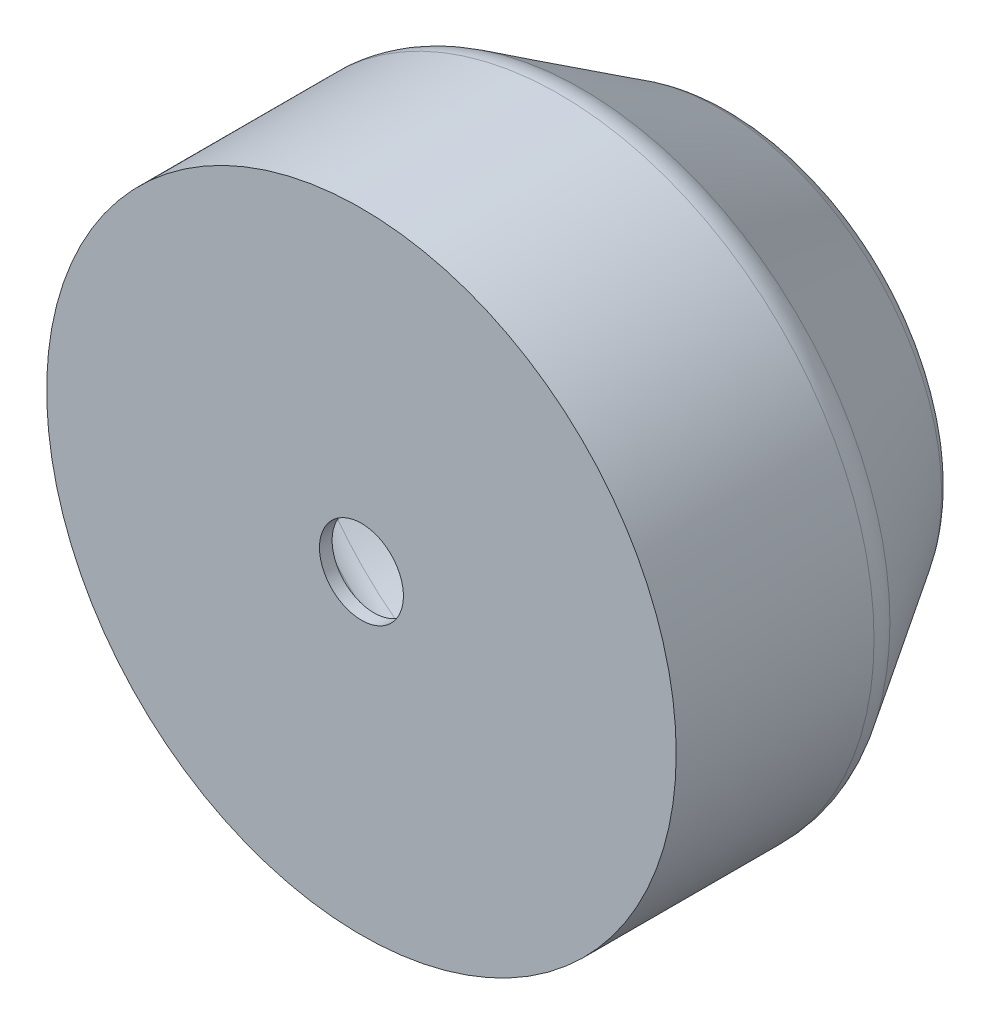
ISO-10303-21;
HEADER;
FILE_DESCRIPTION(('STEP AP214'),'2;1');
FILE_NAME('part.step','',(''),(''),'','','');
FILE_SCHEMA(('AUTOMOTIVE_DESIGN { 1 0 10303 214 1 1 1 1 }'));
ENDSEC;
DATA;
#1=APPLICATION_CONTEXT('core data for automotive mechanical design processes');
#2=APPLICATION_PROTOCOL_DEFINITION('international standard','automotive_design',2000,#1);
#3=PRODUCT_CONTEXT('',#1,'mechanical');
#4=PRODUCT('Part','Part','',(#3));
#5=PRODUCT_RELATED_PRODUCT_CATEGORY('part','',(#4));
#6=PRODUCT_DEFINITION_FORMATION('','',#4);
#7=PRODUCT_DEFINITION_CONTEXT('part definition',#1,'design');
#8=PRODUCT_DEFINITION('design','',#6,#7);
#9=PRODUCT_DEFINITION_SHAPE('','',#8);
#10=(LENGTH_UNIT() NAMED_UNIT(*) SI_UNIT(.MILLI.,.METRE.));
#11=(NAMED_UNIT(*) PLANE_ANGLE_UNIT() SI_UNIT($,.RADIAN.));
#12=(NAMED_UNIT(*) SI_UNIT($,.STERADIAN.) SOLID_ANGLE_UNIT());
#13=UNCERTAINTY_MEASURE_WITH_UNIT(LENGTH_MEASURE(1.E-05),#10,'distance_accuracy_value','');
#14=(GEOMETRIC_REPRESENTATION_CONTEXT(3) GLOBAL_UNCERTAINTY_ASSIGNED_CONTEXT((#13)) GLOBAL_UNIT_ASSIGNED_CONTEXT((#10,
#11,#12)) REPRESENTATION_CONTEXT('',''));
#15=CARTESIAN_POINT('',(0.,0.,0.));
#16=DIRECTION('',(0.,0.,1.));
#17=DIRECTION('',(1.,0.,0.));
#18=AXIS2_PLACEMENT_3D('',#15,#16,#17);
#19=CARTESIAN_POINT('',(0.,0.,50.));
#20=DIRECTION('',(0.,0.,-1.));
#21=DIRECTION('',(-1.,0.,0.));
#22=AXIS2_PLACEMENT_3D('',#19,#20,#21);
#23=CYLINDRICAL_SURFACE('',#22,10.);
#24=CARTESIAN_POINT('',(0.,0.,-40.));
#25=DIRECTION('',(0.,0.,-1.));
#26=DIRECTION('',(-1.,0.,0.));
#27=AXIS2_PLACEMENT_3D('',#24,#25,#26);
#28=CIRCLE('',#27,10.);
#29=CARTESIAN_POINT('',(-10.,0.,-40.));
#30=VERTEX_POINT('',#29);
#31=EDGE_CURVE('E57',#30,#30,#28,.T.);
#32=CARTESIAN_POINT('',(0.,0.,-37.));
#33=DIRECTION('',(0.,0.,-1.));
#34=DIRECTION('',(-1.,0.,0.));
#35=AXIS2_PLACEMENT_3D('',#32,#33,#34);
#36=CIRCLE('',#35,10.);
#37=CARTESIAN_POINT('',(-10.,0.,-37.));
#38=VERTEX_POINT('',#37);
#39=EDGE_CURVE('E63',#38,#38,#36,.T.);
#40=CARTESIAN_POINT('',(-10.,0.,-40.));
#41=CARTESIAN_POINT('',(-10.,0.,-39.96875));
#42=CARTESIAN_POINT('',(-10.,0.,-39.9375));
#43=CARTESIAN_POINT('',(-10.,0.,-39.875));
#44=CARTESIAN_POINT('',(-10.,0.,-39.84375));
#45=CARTESIAN_POINT('',(-10.,0.,-39.78125));
#46=CARTESIAN_POINT('',(-10.,0.,-39.75));
#47=CARTESIAN_POINT('',(-10.,0.,-39.6875));
#48=CARTESIAN_POINT('',(-10.,0.,-39.65625));
#49=CARTESIAN_POINT('',(-10.,0.,-39.59375));
#50=CARTESIAN_POINT('',(-10.,0.,-39.5625));
#51=CARTESIAN_POINT('',(-10.,0.,-39.5));
#52=CARTESIAN_POINT('',(-10.,0.,-39.46875));
#53=CARTESIAN_POINT('',(-10.,0.,-39.40625));
#54=CARTESIAN_POINT('',(-10.,0.,-39.375));
#55=CARTESIAN_POINT('',(-10.,0.,-39.3125));
#56=CARTESIAN_POINT('',(-10.,0.,-39.28125));
#57=CARTESIAN_POINT('',(-10.,0.,-39.21875));
#58=CARTESIAN_POINT('',(-10.,0.,-39.1875));
#59=CARTESIAN_POINT('',(-10.,0.,-39.125));
#60=CARTESIAN_POINT('',(-10.,0.,-39.09375));
#61=CARTESIAN_POINT('',(-10.,0.,-39.03125));
#62=CARTESIAN_POINT('',(-10.,0.,-39.));
#63=CARTESIAN_POINT('',(-10.,0.,-38.9375));
#64=CARTESIAN_POINT('',(-10.,0.,-38.90625));
#65=CARTESIAN_POINT('',(-10.,0.,-38.84375));
#66=CARTESIAN_POINT('',(-10.,0.,-38.8125));
#67=CARTESIAN_POINT('',(-10.,0.,-38.75));
#68=CARTESIAN_POINT('',(-10.,0.,-38.71875));
#69=CARTESIAN_POINT('',(-10.,0.,-38.65625));
#70=CARTESIAN_POINT('',(-10.,0.,-38.625));
#71=CARTESIAN_POINT('',(-10.,0.,-38.5625));
#72=CARTESIAN_POINT('',(-10.,0.,-38.53125));
#73=CARTESIAN_POINT('',(-10.,0.,-38.46875));
#74=CARTESIAN_POINT('',(-10.,0.,-38.4375));
#75=CARTESIAN_POINT('',(-10.,0.,-38.375));
#76=CARTESIAN_POINT('',(-10.,0.,-38.34375));
#77=CARTESIAN_POINT('',(-10.,0.,-38.28125));
#78=CARTESIAN_POINT('',(-10.,0.,-38.25));
#79=CARTESIAN_POINT('',(-10.,0.,-38.1875));
#80=CARTESIAN_POINT('',(-10.,0.,-38.15625));
#81=CARTESIAN_POINT('',(-10.,0.,-38.09375));
#82=CARTESIAN_POINT('',(-10.,0.,-38.0625));
#83=CARTESIAN_POINT('',(-10.,0.,-38.));
#84=CARTESIAN_POINT('',(-10.,0.,-37.96875));
#85=CARTESIAN_POINT('',(-10.,0.,-37.90625));
#86=CARTESIAN_POINT('',(-10.,0.,-37.875));
#87=CARTESIAN_POINT('',(-10.,0.,-37.8125));
#88=CARTESIAN_POINT('',(-10.,0.,-37.78125));
#89=CARTESIAN_POINT('',(-10.,0.,-37.71875));
#90=CARTESIAN_POINT('',(-10.,0.,-37.6875));
#91=CARTESIAN_POINT('',(-10.,0.,-37.625));
#92=CARTESIAN_POINT('',(-10.,0.,-37.59375));
#93=CARTESIAN_POINT('',(-10.,0.,-37.53125));
#94=CARTESIAN_POINT('',(-10.,0.,-37.5));
#95=CARTESIAN_POINT('',(-10.,0.,-37.4375));
#96=CARTESIAN_POINT('',(-10.,0.,-37.40625));
#97=CARTESIAN_POINT('',(-10.,0.,-37.34375));
#98=CARTESIAN_POINT('',(-10.,0.,-37.3125));
#99=CARTESIAN_POINT('',(-10.,0.,-37.25));
#100=CARTESIAN_POINT('',(-10.,0.,-37.21875));
#101=CARTESIAN_POINT('',(-10.,0.,-37.15625));
#102=CARTESIAN_POINT('',(-10.,0.,-37.125));
#103=CARTESIAN_POINT('',(-10.,0.,-37.0625));
#104=CARTESIAN_POINT('',(-10.,0.,-37.03125));
#105=CARTESIAN_POINT('',(-10.,0.,-37.));
#106=B_SPLINE_CURVE_WITH_KNOTS('',3,(#40,#41,#42,#43,#44,#45,#46,#47,#48,#49,#50,#51,#52,#53,
#54,#55,#56,#57,#58,#59,#60,#61,#62,#63,#64,#65,#66,#67,#68,#69,#70,#71,#72,#73,#74,#75,#76,#77,
#78,#79,#80,#81,#82,#83,#84,#85,#86,#87,#88,#89,#90,#91,#92,#93,#94,#95,#96,#97,#98,#99,#100,
#101,#102,#103,#104,#105),.UNSPECIFIED.,.F.,.F.,(4,2,2,2,2,2,2,2,2,2,2,2,2,2,2,2,2,2,2,2,2,2,2,
2,2,2,2,2,2,2,2,2,4),(0.,0.0937500000000036,0.187500000000007,0.281249999999997,0.375,
0.468750000000004,0.562499999999994,0.656249999999997,0.750000000000001,0.843750000000004,
0.937500000000008,1.03125,1.125,1.21875,1.31249999999999,1.40625,1.5,1.59375,1.68750000000001,
1.78125,1.875,1.96875000000001,2.06249999999999,2.15625,2.25,2.34375000000001,2.43750000000001,
2.53125,2.625,2.71875000000001,2.8125,2.90625,3.),.UNSPECIFIED.);
#107=EDGE_CURVE('BSEAM33',#30,#38,#106,.T.);
#108=ORIENTED_EDGE('',*,*,#31,.T.);
#109=ORIENTED_EDGE('',*,*,#39,.F.);
#110=ORIENTED_EDGE('',*,*,#107,.T.);
#111=ORIENTED_EDGE('',*,*,#107,.F.);
#112=EDGE_LOOP('',(#108,#110,#109,#111));
#113=FACE_BOUND('',#112,.T.);
#114=ADVANCED_FACE('F33',(#113),#23,.F.);
#115=CARTESIAN_POINT('',(0.,0.,50.));
#116=DIRECTION('',(0.,0.,-1.));
#117=DIRECTION('',(-1.,0.,0.));
#118=AXIS2_PLACEMENT_3D('',#115,#116,#117);
#119=CYLINDRICAL_SURFACE('',#118,75.);
#120=CARTESIAN_POINT('',(0.,0.,2.86796226411316));
#121=DIRECTION('',(0.,0.,1.));
#122=DIRECTION('',(1.,0.,0.));
#123=AXIS2_PLACEMENT_3D('',#120,#121,#122);
#124=CIRCLE('',#123,75.);
#125=CARTESIAN_POINT('',(75.,0.,2.86796226411316));
#126=VERTEX_POINT('',#125);
#127=EDGE_CURVE('E11',#126,#126,#124,.T.);
#128=ORIENTED_EDGE('',*,*,#127,.T.);
#129=EDGE_LOOP('',(#128));
#130=FACE_BOUND('',#129,.T.);
#131=CARTESIAN_POINT('',(0.,0.,50.));
#132=DIRECTION('',(0.,0.,1.));
#133=DIRECTION('',(1.,0.,0.));
#134=AXIS2_PLACEMENT_3D('',#131,#132,#133);
#135=CIRCLE('',#134,75.);
#136=CARTESIAN_POINT('',(75.,0.,50.));
#137=VERTEX_POINT('',#136);
#138=EDGE_CURVE('E53',#137,#137,#135,.T.);
#139=ORIENTED_EDGE('',*,*,#138,.F.);
#140=EDGE_LOOP('',(#139));
#141=FACE_BOUND('',#140,.T.);
#142=ADVANCED_FACE('F107',(#130,#141),#119,.T.);
#143=CARTESIAN_POINT('',(0.,0.,50.));
#144=DIRECTION('',(0.,0.,1.));
#145=DIRECTION('',(1.,0.,0.));
#146=AXIS2_PLACEMENT_3D('',#143,#144,#145);
#147=PLANE('',#146);
#148=CARTESIAN_POINT('',(0.,0.,50.));
#149=DIRECTION('',(0.,0.,-1.));
#150=DIRECTION('',(-1.,0.,0.));
#151=AXIS2_PLACEMENT_3D('',#148,#149,#150);
#152=CIRCLE('',#151,10.);
#153=CARTESIAN_POINT('',(-10.,0.,50.));
#154=VERTEX_POINT('',#153);
#155=EDGE_CURVE('E56',#154,#154,#152,.T.);
#156=ORIENTED_EDGE('',*,*,#155,.T.);
#157=EDGE_LOOP('',(#156));
#158=FACE_BOUND('',#157,.T.);
#159=ORIENTED_EDGE('',*,*,#138,.T.);
#160=EDGE_LOOP('',(#159));
#161=FACE_BOUND('',#160,.T.);
#162=ADVANCED_FACE('F113',(#158,#161),#147,.T.);
#163=CARTESIAN_POINT('',(0.,0.,-40.));
#164=DIRECTION('',(0.,0.,-1.));
#165=DIRECTION('',(-1.,0.,0.));
#166=AXIS2_PLACEMENT_3D('',#163,#164,#165);
#167=PLANE('',#166);
#168=ORIENTED_EDGE('',*,*,#31,.F.);
#169=EDGE_LOOP('',(#168));
#170=FACE_BOUND('',#169,.T.);
#171=CARTESIAN_POINT('',(0.,0.,-40.));
#172=DIRECTION('',(0.,0.,-1.));
#173=DIRECTION('',(-1.,0.,0.));
#174=AXIS2_PLACEMENT_3D('',#171,#172,#173);
#175=CIRCLE('',#174,44.4575235849292);
#176=CARTESIAN_POINT('',(-44.4575235849292,0.,-40.));
#177=VERTEX_POINT('',#176);
#178=EDGE_CURVE('E48',#177,#177,#175,.T.);
#179=ORIENTED_EDGE('',*,*,#178,.T.);
#180=EDGE_LOOP('',(#179));
#181=FACE_BOUND('',#180,.T.);
#182=ADVANCED_FACE('F130',(#170,#181),#167,.T.);
#183=CARTESIAN_POINT('',(0.,0.,-40.));
#184=DIRECTION('',(0.,0.,1.));
#185=DIRECTION('',(1.,0.,0.));
#186=AXIS2_PLACEMENT_3D('',#183,#184,#185);
#187=CONICAL_SURFACE('',#186,50.,0.558599315343563);
#188=CARTESIAN_POINT('',(0.,0.,-35.2999894000318));
#189=DIRECTION('',(0.,0.,-1.));
#190=DIRECTION('',(-1.,0.,0.));
#191=AXIS2_PLACEMENT_3D('',#188,#189,#190);
#192=CIRCLE('',#191,52.9375066249801);
#193=CARTESIAN_POINT('',(-52.9375066249801,0.,-35.2999894000318));
#194=VERTEX_POINT('',#193);
#195=EDGE_CURVE('E40',#194,#194,#192,.F.);
#196=ORIENTED_EDGE('',*,*,#195,.T.);
#197=EDGE_LOOP('',(#196));
#198=FACE_BOUND('',#197,.T.);
#199=CARTESIAN_POINT('',(0.,0.,-2.43202713591865));
#200=DIRECTION('',(0.,0.,1.));
#201=DIRECTION('',(1.,0.,0.));
#202=AXIS2_PLACEMENT_3D('',#199,#200,#201);
#203=CIRCLE('',#202,73.4799830400509);
#204=CARTESIAN_POINT('',(73.4799830400509,0.,-2.43202713591865));
#205=VERTEX_POINT('',#204);
#206=EDGE_CURVE('E44',#205,#205,#203,.F.);
#207=ORIENTED_EDGE('',*,*,#206,.T.);
#208=EDGE_LOOP('',(#207));
#209=FACE_BOUND('',#208,.T.);
#210=ADVANCED_FACE('F137',(#198,#209),#187,.T.);
#211=CARTESIAN_POINT('',(0.,0.,-30.));
#212=DIRECTION('',(0.,0.,-1.));
#213=DIRECTION('',(-1.,0.,0.));
#214=AXIS2_PLACEMENT_3D('',#211,#212,#213);
#215=TOROIDAL_SURFACE('',#214,44.4575235849292,10.);
#216=ORIENTED_EDGE('',*,*,#195,.F.);
#217=EDGE_LOOP('',(#216));
#218=FACE_BOUND('',#217,.T.);
#219=ORIENTED_EDGE('',*,*,#178,.F.);
#220=EDGE_LOOP('',(#219));
#221=FACE_BOUND('',#220,.T.);
#222=ADVANCED_FACE('F123',(#218,#221),#215,.T.);
#223=CARTESIAN_POINT('',(0.,0.,2.86796226411316));
#224=DIRECTION('',(0.,0.,1.));
#225=DIRECTION('',(1.,0.,0.));
#226=AXIS2_PLACEMENT_3D('',#223,#224,#225);
#227=TOROIDAL_SURFACE('',#226,65.,10.);
#228=ORIENTED_EDGE('',*,*,#127,.F.);
#229=EDGE_LOOP('',(#228));
#230=FACE_BOUND('',#229,.T.);
#231=ORIENTED_EDGE('',*,*,#206,.F.);
#232=EDGE_LOOP('',(#231));
#233=FACE_BOUND('',#232,.T.);
#234=ADVANCED_FACE('F35',(#230,#233),#227,.T.);
#235=CARTESIAN_POINT('',(0.,0.,47.));
#236=DIRECTION('',(0.,0.,1.));
#237=DIRECTION('',(1.,0.,0.));
#238=AXIS2_PLACEMENT_3D('',#235,#236,#237);
#239=CIRCLE('',#238,10.);
#240=CARTESIAN_POINT('',(-10.,0.,47.));
#241=VERTEX_POINT('',#240);
#242=EDGE_CURVE('E66',#241,#241,#239,.F.);
#243=CARTESIAN_POINT('',(-10.,0.,47.));
#244=CARTESIAN_POINT('',(-10.,0.,47.03125));
#245=CARTESIAN_POINT('',(-10.,0.,47.0625));
#246=CARTESIAN_POINT('',(-10.,0.,47.125));
#247=CARTESIAN_POINT('',(-10.,0.,47.15625));
#248=CARTESIAN_POINT('',(-10.,0.,47.21875));
#249=CARTESIAN_POINT('',(-10.,0.,47.25));
#250=CARTESIAN_POINT('',(-10.,0.,47.3125));
#251=CARTESIAN_POINT('',(-10.,0.,47.34375));
#252=CARTESIAN_POINT('',(-10.,0.,47.40625));
#253=CARTESIAN_POINT('',(-10.,0.,47.4375));
#254=CARTESIAN_POINT('',(-10.,0.,47.5));
#255=CARTESIAN_POINT('',(-10.,0.,47.53125));
#256=CARTESIAN_POINT('',(-10.,0.,47.59375));
#257=CARTESIAN_POINT('',(-10.,0.,47.625));
#258=CARTESIAN_POINT('',(-10.,0.,47.6875));
#259=CARTESIAN_POINT('',(-10.,0.,47.71875));
#260=CARTESIAN_POINT('',(-10.,0.,47.78125));
#261=CARTESIAN_POINT('',(-10.,0.,47.8125));
#262=CARTESIAN_POINT('',(-10.,0.,47.875));
#263=CARTESIAN_POINT('',(-10.,0.,47.90625));
#264=CARTESIAN_POINT('',(-10.,0.,47.96875));
#265=CARTESIAN_POINT('',(-10.,0.,48.));
#266=CARTESIAN_POINT('',(-10.,0.,48.0625));
#267=CARTESIAN_POINT('',(-10.,0.,48.09375));
#268=CARTESIAN_POINT('',(-10.,0.,48.15625));
#269=CARTESIAN_POINT('',(-10.,0.,48.1875));
#270=CARTESIAN_POINT('',(-10.,0.,48.25));
#271=CARTESIAN_POINT('',(-10.,0.,48.28125));
#272=CARTESIAN_POINT('',(-10.,0.,48.34375));
#273=CARTESIAN_POINT('',(-10.,0.,48.375));
#274=CARTESIAN_POINT('',(-10.,0.,48.4375));
#275=CARTESIAN_POINT('',(-10.,0.,48.46875));
#276=CARTESIAN_POINT('',(-10.,0.,48.53125));
#277=CARTESIAN_POINT('',(-10.,0.,48.5625));
#278=CARTESIAN_POINT('',(-10.,0.,48.625));
#279=CARTESIAN_POINT('',(-10.,0.,48.65625));
#280=CARTESIAN_POINT('',(-10.,0.,48.71875));
#281=CARTESIAN_POINT('',(-10.,0.,48.75));
#282=CARTESIAN_POINT('',(-10.,0.,48.8125));
#283=CARTESIAN_POINT('',(-10.,0.,48.84375));
#284=CARTESIAN_POINT('',(-10.,0.,48.90625));
#285=CARTESIAN_POINT('',(-10.,0.,48.9375));
#286=CARTESIAN_POINT('',(-10.,0.,49.));
#287=CARTESIAN_POINT('',(-10.,0.,49.03125));
#288=CARTESIAN_POINT('',(-10.,0.,49.09375));
#289=CARTESIAN_POINT('',(-10.,0.,49.125));
#290=CARTESIAN_POINT('',(-10.,0.,49.1875));
#291=CARTESIAN_POINT('',(-10.,0.,49.21875));
#292=CARTESIAN_POINT('',(-10.,0.,49.28125));
#293=CARTESIAN_POINT('',(-10.,0.,49.3125));
#294=CARTESIAN_POINT('',(-10.,0.,49.375));
#295=CARTESIAN_POINT('',(-10.,0.,49.40625));
#296=CARTESIAN_POINT('',(-10.,0.,49.46875));
#297=CARTESIAN_POINT('',(-10.,0.,49.5));
#298=CARTESIAN_POINT('',(-10.,0.,49.5625));
#299=CARTESIAN_POINT('',(-10.,0.,49.59375));
#300=CARTESIAN_POINT('',(-10.,0.,49.65625));
#301=CARTESIAN_POINT('',(-10.,0.,49.6875));
#302=CARTESIAN_POINT('',(-10.,0.,49.75));
#303=CARTESIAN_POINT('',(-10.,0.,49.78125));
#304=CARTESIAN_POINT('',(-10.,0.,49.84375));
#305=CARTESIAN_POINT('',(-10.,0.,49.875));
#306=CARTESIAN_POINT('',(-10.,0.,49.9375));
#307=CARTESIAN_POINT('',(-10.,0.,49.96875));
#308=CARTESIAN_POINT('',(-10.,0.,50.));
#309=B_SPLINE_CURVE_WITH_KNOTS('',3,(#243,#244,#245,#246,#247,#248,#249,#250,#251,#252,#253,
#254,#255,#256,#257,#258,#259,#260,#261,#262,#263,#264,#265,#266,#267,#268,#269,#270,#271,#272,
#273,#274,#275,#276,#277,#278,#279,#280,#281,#282,#283,#284,#285,#286,#287,#288,#289,#290,#291,
#292,#293,#294,#295,#296,#297,#298,#299,#300,#301,#302,#303,#304,#305,#306,#307,#308),
.UNSPECIFIED.,.F.,.F.,(4,2,2,2,2,2,2,2,2,2,2,2,2,2,2,2,2,2,2,2,2,2,2,2,2,2,2,2,2,2,2,2,4),(0.,
0.0937500000000036,0.1875,0.281250000000004,0.375,0.468750000000004,0.5625,0.656250000000004,
0.750000000000001,0.843750000000004,0.937500000000001,1.03125,1.125,1.21875,1.3125,1.40625,1.5,
1.59375,1.6875,1.78125000000001,1.875,1.96875000000001,2.0625,2.15625000000001,2.25000000000001,
2.34375000000001,2.43750000000001,2.53125000000001,2.62500000000001,2.71875000000001,
2.81250000000001,2.90625000000001,3.),.UNSPECIFIED.);
#310=EDGE_CURVE('BSEAM91',#241,#154,#309,.T.);
#311=ORIENTED_EDGE('',*,*,#242,.T.);
#312=ORIENTED_EDGE('',*,*,#155,.F.);
#313=ORIENTED_EDGE('',*,*,#310,.T.);
#314=ORIENTED_EDGE('',*,*,#310,.F.);
#315=EDGE_LOOP('',(#311,#313,#312,#314));
#316=FACE_BOUND('',#315,.T.);
#317=ADVANCED_FACE('F91',(#316),#23,.F.);
#318=CARTESIAN_POINT('',(0.,0.,50.));
#319=DIRECTION('',(0.,0.,-1.));
#320=DIRECTION('',(-1.,0.,0.));
#321=AXIS2_PLACEMENT_3D('',#318,#319,#320);
#322=CYLINDRICAL_SURFACE('',#321,72.);
#323=CARTESIAN_POINT('',(0.,0.,2.86796226411316));
#324=DIRECTION('',(0.,0.,-1.));
#325=DIRECTION('',(-1.,0.,0.));
#326=AXIS2_PLACEMENT_3D('',#323,#324,#325);
#327=CIRCLE('',#326,72.);
#328=CARTESIAN_POINT('',(-72.,0.,2.86796226411316));
#329=VERTEX_POINT('',#328);
#330=EDGE_CURVE('E60',#329,#329,#327,.F.);
#331=ORIENTED_EDGE('',*,*,#330,.F.);
#332=EDGE_LOOP('',(#331));
#333=FACE_BOUND('',#332,.T.);
#334=CARTESIAN_POINT('',(0.,0.,47.));
#335=DIRECTION('',(0.,0.,1.));
#336=DIRECTION('',(1.,0.,0.));
#337=AXIS2_PLACEMENT_3D('',#334,#335,#336);
#338=CIRCLE('',#337,72.);
#339=CARTESIAN_POINT('',(72.,0.,47.));
#340=VERTEX_POINT('',#339);
#341=EDGE_CURVE('E69',#340,#340,#338,.T.);
#342=ORIENTED_EDGE('',*,*,#341,.T.);
#343=EDGE_LOOP('',(#342));
#344=FACE_BOUND('',#343,.T.);
#345=ADVANCED_FACE('F87',(#333,#344),#322,.F.);
#346=CARTESIAN_POINT('',(0.,0.,47.));
#347=DIRECTION('',(0.,0.,1.));
#348=DIRECTION('',(1.,0.,0.));
#349=AXIS2_PLACEMENT_3D('',#346,#347,#348);
#350=PLANE('',#349);
#351=ORIENTED_EDGE('',*,*,#242,.F.);
#352=EDGE_LOOP('',(#351));
#353=FACE_BOUND('',#352,.T.);
#354=ORIENTED_EDGE('',*,*,#341,.F.);
#355=EDGE_LOOP('',(#354));
#356=FACE_BOUND('',#355,.T.);
#357=ADVANCED_FACE('F90',(#353,#356),#350,.F.);
#358=CARTESIAN_POINT('',(0.,0.,-37.));
#359=DIRECTION('',(0.,0.,-1.));
#360=DIRECTION('',(-1.,0.,0.));
#361=AXIS2_PLACEMENT_3D('',#358,#359,#360);
#362=PLANE('',#361);
#363=ORIENTED_EDGE('',*,*,#39,.T.);
#364=EDGE_LOOP('',(#363));
#365=FACE_BOUND('',#364,.T.);
#366=CARTESIAN_POINT('',(0.,0.,-37.));
#367=DIRECTION('',(0.,0.,-1.));
#368=DIRECTION('',(-1.,0.,0.));
#369=AXIS2_PLACEMENT_3D('',#366,#367,#368);
#370=CIRCLE('',#369,44.4575235849292);
#371=CARTESIAN_POINT('',(-44.4575235849292,0.,-37.));
#372=VERTEX_POINT('',#371);
#373=EDGE_CURVE('E70',#372,#372,#370,.T.);
#374=ORIENTED_EDGE('',*,*,#373,.F.);
#375=EDGE_LOOP('',(#374));
#376=FACE_BOUND('',#375,.T.);
#377=ADVANCED_FACE('F96',(#365,#376),#362,.F.);
#378=CARTESIAN_POINT('',(0.,0.,-38.4100031799905));
#379=DIRECTION('',(0.,0.,1.));
#380=DIRECTION('',(1.,0.,0.));
#381=AXIS2_PLACEMENT_3D('',#378,#379,#380);
#382=CONICAL_SURFACE('',#381,47.4560050879847,0.558599315343563);
#383=CARTESIAN_POINT('',(0.,0.,-33.7099925800223));
#384=DIRECTION('',(0.,0.,1.));
#385=DIRECTION('',(1.,0.,0.));
#386=AXIS2_PLACEMENT_3D('',#383,#384,#385);
#387=CIRCLE('',#386,50.3935117129649);
#388=CARTESIAN_POINT('',(50.3935117129649,0.,-33.7099925800223));
#389=VERTEX_POINT('',#388);
#390=EDGE_CURVE('E74',#389,#389,#387,.T.);
#391=ORIENTED_EDGE('',*,*,#390,.F.);
#392=EDGE_LOOP('',(#391));
#393=FACE_BOUND('',#392,.T.);
#394=CARTESIAN_POINT('',(0.,0.,-0.842030315909105));
#395=DIRECTION('',(0.,0.,1.));
#396=DIRECTION('',(1.,0.,0.));
#397=AXIS2_PLACEMENT_3D('',#394,#395,#396);
#398=CIRCLE('',#397,70.9359881280356);
#399=CARTESIAN_POINT('',(70.9359881280356,0.,-0.842030315909105));
#400=VERTEX_POINT('',#399);
#401=EDGE_CURVE('E73',#400,#400,#398,.F.);
#402=ORIENTED_EDGE('',*,*,#401,.F.);
#403=EDGE_LOOP('',(#402));
#404=FACE_BOUND('',#403,.T.);
#405=ADVANCED_FACE('F102',(#393,#404),#382,.F.);
#406=CARTESIAN_POINT('',(0.,0.,-30.));
#407=DIRECTION('',(0.,0.,-1.));
#408=DIRECTION('',(-1.,0.,0.));
#409=AXIS2_PLACEMENT_3D('',#406,#407,#408);
#410=TOROIDAL_SURFACE('',#409,44.4575235849292,7.);
#411=ORIENTED_EDGE('',*,*,#390,.T.);
#412=EDGE_LOOP('',(#411));
#413=FACE_BOUND('',#412,.T.);
#414=ORIENTED_EDGE('',*,*,#373,.T.);
#415=EDGE_LOOP('',(#414));
#416=FACE_BOUND('',#415,.T.);
#417=ADVANCED_FACE('F195',(#413,#416),#410,.F.);
#418=CARTESIAN_POINT('',(0.,0.,2.86796226411316));
#419=DIRECTION('',(0.,0.,1.));
#420=DIRECTION('',(1.,0.,0.));
#421=AXIS2_PLACEMENT_3D('',#418,#419,#420);
#422=TOROIDAL_SURFACE('',#421,65.,7.);
#423=ORIENTED_EDGE('',*,*,#330,.T.);
#424=EDGE_LOOP('',(#423));
#425=FACE_BOUND('',#424,.T.);
#426=ORIENTED_EDGE('',*,*,#401,.T.);
#427=EDGE_LOOP('',(#426));
#428=FACE_BOUND('',#427,.T.);
#429=ADVANCED_FACE('F84',(#425,#428),#422,.F.);
#430=CLOSED_SHELL('',(#114,#142,#162,#182,#210,#222,#234,#317,#345,#357,#377,#405,#417,#429));
#431=MANIFOLD_SOLID_BREP('B2',#430);
#432=ADVANCED_BREP_SHAPE_REPRESENTATION('',(#18,#431),#14);
#433=SHAPE_DEFINITION_REPRESENTATION(#9,#432);
ENDSEC;
END-ISO-10303-21;
